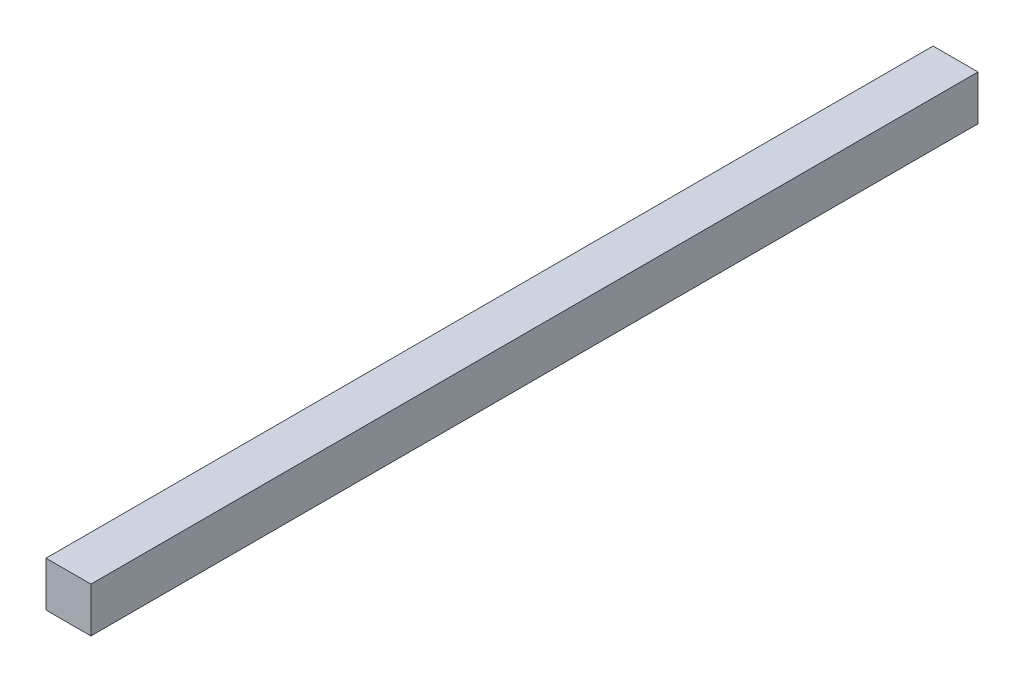
ISO-10303-21;
HEADER;
FILE_DESCRIPTION(('STEP AP214'),'2;1');
FILE_NAME('part.step','',(''),(''),'','','');
FILE_SCHEMA(('AUTOMOTIVE_DESIGN { 1 0 10303 214 1 1 1 1 }'));
ENDSEC;
DATA;
#1=APPLICATION_CONTEXT('core data for automotive mechanical design processes');
#2=APPLICATION_PROTOCOL_DEFINITION('international standard','automotive_design',2000,#1);
#3=PRODUCT_CONTEXT('',#1,'mechanical');
#4=PRODUCT('Part','Part','',(#3));
#5=PRODUCT_RELATED_PRODUCT_CATEGORY('part','',(#4));
#6=PRODUCT_DEFINITION_FORMATION('','',#4);
#7=PRODUCT_DEFINITION_CONTEXT('part definition',#1,'design');
#8=PRODUCT_DEFINITION('design','',#6,#7);
#9=PRODUCT_DEFINITION_SHAPE('','',#8);
#10=(LENGTH_UNIT() NAMED_UNIT(*) SI_UNIT(.MILLI.,.METRE.));
#11=(NAMED_UNIT(*) PLANE_ANGLE_UNIT() SI_UNIT($,.RADIAN.));
#12=(NAMED_UNIT(*) SI_UNIT($,.STERADIAN.) SOLID_ANGLE_UNIT());
#13=UNCERTAINTY_MEASURE_WITH_UNIT(LENGTH_MEASURE(1.E-05),#10,'distance_accuracy_value','');
#14=(GEOMETRIC_REPRESENTATION_CONTEXT(3) GLOBAL_UNCERTAINTY_ASSIGNED_CONTEXT((#13)) GLOBAL_UNIT_ASSIGNED_CONTEXT((#10,
#11,#12)) REPRESENTATION_CONTEXT('',''));
#15=CARTESIAN_POINT('',(0.,0.,0.));
#16=DIRECTION('',(0.,0.,1.));
#17=DIRECTION('',(1.,0.,0.));
#18=AXIS2_PLACEMENT_3D('',#15,#16,#17);
#19=CARTESIAN_POINT('',(0.,0.,-395.));
#20=DIRECTION('',(-1.,0.,0.));
#21=DIRECTION('',(0.,0.,1.));
#22=AXIS2_PLACEMENT_3D('',#19,#20,#21);
#23=PLANE('',#22);
#24=DIRECTION('',(0.,-1.,0.));
#25=VECTOR('',#24,1.);
#26=CARTESIAN_POINT('',(0.,0.,0.));
#27=LINE('',#26,#25);
#28=CARTESIAN_POINT('',(0.,20.,0.));
#29=VERTEX_POINT('',#28);
#30=CARTESIAN_POINT('',(0.,0.,0.));
#31=VERTEX_POINT('',#30);
#32=EDGE_CURVE('E97',#29,#31,#27,.T.);
#33=ORIENTED_EDGE('',*,*,#32,.F.);
#34=DIRECTION('',(0.,0.,1.));
#35=VECTOR('',#34,1.);
#36=CARTESIAN_POINT('',(0.,20.,-395.));
#37=LINE('',#36,#35);
#38=CARTESIAN_POINT('',(0.,20.,-395.));
#39=VERTEX_POINT('',#38);
#40=EDGE_CURVE('E11',#39,#29,#37,.T.);
#41=ORIENTED_EDGE('',*,*,#40,.F.);
#42=DIRECTION('',(0.,-1.,0.));
#43=VECTOR('',#42,1.);
#44=CARTESIAN_POINT('',(0.,0.,-395.));
#45=LINE('',#44,#43);
#46=CARTESIAN_POINT('',(0.,0.,-395.));
#47=VERTEX_POINT('',#46);
#48=EDGE_CURVE('E91',#39,#47,#45,.T.);
#49=ORIENTED_EDGE('',*,*,#48,.T.);
#50=DIRECTION('',(0.,0.,1.));
#51=VECTOR('',#50,1.);
#52=CARTESIAN_POINT('',(0.,0.,-395.));
#53=LINE('',#52,#51);
#54=EDGE_CURVE('E36',#47,#31,#53,.T.);
#55=ORIENTED_EDGE('',*,*,#54,.T.);
#56=EDGE_LOOP('',(#33,#41,#49,#55));
#57=FACE_BOUND('',#56,.T.);
#58=ADVANCED_FACE('F33',(#57),#23,.T.);
#59=CARTESIAN_POINT('',(0.,20.,-395.));
#60=DIRECTION('',(0.,1.,0.));
#61=DIRECTION('',(0.,0.,1.));
#62=AXIS2_PLACEMENT_3D('',#59,#60,#61);
#63=PLANE('',#62);
#64=DIRECTION('',(-1.,0.,0.));
#65=VECTOR('',#64,1.);
#66=CARTESIAN_POINT('',(0.,20.,0.));
#67=LINE('',#66,#65);
#68=CARTESIAN_POINT('',(20.,20.,0.));
#69=VERTEX_POINT('',#68);
#70=EDGE_CURVE('E93',#69,#29,#67,.T.);
#71=ORIENTED_EDGE('',*,*,#70,.F.);
#72=DIRECTION('',(0.,0.,1.));
#73=VECTOR('',#72,1.);
#74=CARTESIAN_POINT('',(20.,20.,-395.));
#75=LINE('',#74,#73);
#76=CARTESIAN_POINT('',(20.,20.,-395.));
#77=VERTEX_POINT('',#76);
#78=EDGE_CURVE('E42',#77,#69,#75,.T.);
#79=ORIENTED_EDGE('',*,*,#78,.F.);
#80=DIRECTION('',(-1.,0.,0.));
#81=VECTOR('',#80,1.);
#82=CARTESIAN_POINT('',(0.,20.,-395.));
#83=LINE('',#82,#81);
#84=EDGE_CURVE('E88',#77,#39,#83,.T.);
#85=ORIENTED_EDGE('',*,*,#84,.T.);
#86=ORIENTED_EDGE('',*,*,#40,.T.);
#87=EDGE_LOOP('',(#71,#79,#85,#86));
#88=FACE_BOUND('',#87,.T.);
#89=ADVANCED_FACE('F107',(#88),#63,.T.);
#90=CARTESIAN_POINT('',(20.,0.,-395.));
#91=DIRECTION('',(1.,0.,0.));
#92=DIRECTION('',(0.,0.,-1.));
#93=AXIS2_PLACEMENT_3D('',#90,#91,#92);
#94=PLANE('',#93);
#95=DIRECTION('',(0.,1.,0.));
#96=VECTOR('',#95,1.);
#97=CARTESIAN_POINT('',(20.,0.,0.));
#98=LINE('',#97,#96);
#99=CARTESIAN_POINT('',(20.,0.,0.));
#100=VERTEX_POINT('',#99);
#101=EDGE_CURVE('E83',#100,#69,#98,.T.);
#102=ORIENTED_EDGE('',*,*,#101,.F.);
#103=DIRECTION('',(0.,0.,1.));
#104=VECTOR('',#103,1.);
#105=CARTESIAN_POINT('',(20.,0.,-395.));
#106=LINE('',#105,#104);
#107=CARTESIAN_POINT('',(20.,0.,-395.));
#108=VERTEX_POINT('',#107);
#109=EDGE_CURVE('E78',#108,#100,#106,.T.);
#110=ORIENTED_EDGE('',*,*,#109,.F.);
#111=DIRECTION('',(0.,1.,0.));
#112=VECTOR('',#111,1.);
#113=CARTESIAN_POINT('',(20.,0.,-395.));
#114=LINE('',#113,#112);
#115=EDGE_CURVE('E81',#108,#77,#114,.T.);
#116=ORIENTED_EDGE('',*,*,#115,.T.);
#117=ORIENTED_EDGE('',*,*,#78,.T.);
#118=EDGE_LOOP('',(#102,#110,#116,#117));
#119=FACE_BOUND('',#118,.T.);
#120=ADVANCED_FACE('F80',(#119),#94,.T.);
#121=CARTESIAN_POINT('',(0.,0.,-395.));
#122=DIRECTION('',(0.,-1.,0.));
#123=DIRECTION('',(0.,0.,-1.));
#124=AXIS2_PLACEMENT_3D('',#121,#122,#123);
#125=PLANE('',#124);
#126=DIRECTION('',(1.,0.,0.));
#127=VECTOR('',#126,1.);
#128=CARTESIAN_POINT('',(0.,0.,0.));
#129=LINE('',#128,#127);
#130=EDGE_CURVE('E100',#31,#100,#129,.T.);
#131=ORIENTED_EDGE('',*,*,#130,.F.);
#132=ORIENTED_EDGE('',*,*,#54,.F.);
#133=DIRECTION('',(1.,0.,0.));
#134=VECTOR('',#133,1.);
#135=CARTESIAN_POINT('',(0.,0.,-395.));
#136=LINE('',#135,#134);
#137=EDGE_CURVE('E87',#47,#108,#136,.T.);
#138=ORIENTED_EDGE('',*,*,#137,.T.);
#139=ORIENTED_EDGE('',*,*,#109,.T.);
#140=EDGE_LOOP('',(#131,#132,#138,#139));
#141=FACE_BOUND('',#140,.T.);
#142=ADVANCED_FACE('F90',(#141),#125,.T.);
#143=CARTESIAN_POINT('',(0.,0.,-395.));
#144=DIRECTION('',(0.,0.,-1.));
#145=DIRECTION('',(-1.,0.,0.));
#146=AXIS2_PLACEMENT_3D('',#143,#144,#145);
#147=PLANE('',#146);
#148=ORIENTED_EDGE('',*,*,#48,.F.);
#149=ORIENTED_EDGE('',*,*,#84,.F.);
#150=ORIENTED_EDGE('',*,*,#115,.F.);
#151=ORIENTED_EDGE('',*,*,#137,.F.);
#152=EDGE_LOOP('',(#148,#149,#150,#151));
#153=FACE_BOUND('',#152,.T.);
#154=ADVANCED_FACE('F86',(#153),#147,.T.);
#155=CARTESIAN_POINT('',(0.,0.,0.));
#156=DIRECTION('',(0.,0.,-1.));
#157=DIRECTION('',(-1.,0.,0.));
#158=AXIS2_PLACEMENT_3D('',#155,#156,#157);
#159=PLANE('',#158);
#160=ORIENTED_EDGE('',*,*,#32,.T.);
#161=ORIENTED_EDGE('',*,*,#130,.T.);
#162=ORIENTED_EDGE('',*,*,#101,.T.);
#163=ORIENTED_EDGE('',*,*,#70,.T.);
#164=EDGE_LOOP('',(#160,#161,#162,#163));
#165=FACE_BOUND('',#164,.T.);
#166=ADVANCED_FACE('F106',(#165),#159,.F.);
#167=CLOSED_SHELL('',(#58,#89,#120,#142,#154,#166));
#168=MANIFOLD_SOLID_BREP('B2',#167);
#169=ADVANCED_BREP_SHAPE_REPRESENTATION('',(#18,#168),#14);
#170=SHAPE_DEFINITION_REPRESENTATION(#9,#169);
ENDSEC;
END-ISO-10303-21;
